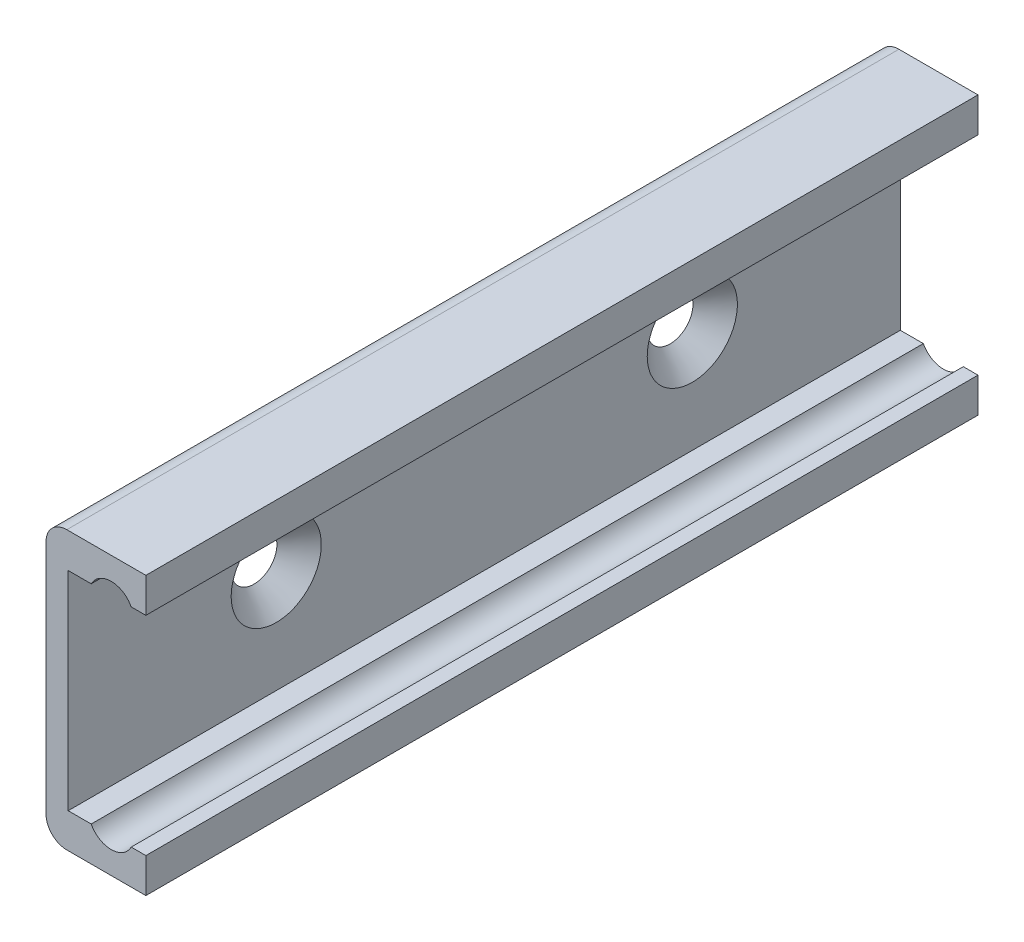
ISO-10303-21;
HEADER;
FILE_DESCRIPTION(('STEP AP214'),'2;1');
FILE_NAME('part.step','',(''),(''),'','','');
FILE_SCHEMA(('AUTOMOTIVE_DESIGN { 1 0 10303 214 1 1 1 1 }'));
ENDSEC;
DATA;
#1=APPLICATION_CONTEXT('core data for automotive mechanical design processes');
#2=APPLICATION_PROTOCOL_DEFINITION('international standard','automotive_design',2000,#1);
#3=PRODUCT_CONTEXT('',#1,'mechanical');
#4=PRODUCT('Part','Part','',(#3));
#5=PRODUCT_RELATED_PRODUCT_CATEGORY('part','',(#4));
#6=PRODUCT_DEFINITION_FORMATION('','',#4);
#7=PRODUCT_DEFINITION_CONTEXT('part definition',#1,'design');
#8=PRODUCT_DEFINITION('design','',#6,#7);
#9=PRODUCT_DEFINITION_SHAPE('','',#8);
#10=(LENGTH_UNIT() NAMED_UNIT(*) SI_UNIT(.MILLI.,.METRE.));
#11=(NAMED_UNIT(*) PLANE_ANGLE_UNIT() SI_UNIT($,.RADIAN.));
#12=(NAMED_UNIT(*) SI_UNIT($,.STERADIAN.) SOLID_ANGLE_UNIT());
#13=UNCERTAINTY_MEASURE_WITH_UNIT(LENGTH_MEASURE(1.E-05),#10,'distance_accuracy_value','');
#14=(GEOMETRIC_REPRESENTATION_CONTEXT(3) GLOBAL_UNCERTAINTY_ASSIGNED_CONTEXT((#13)) GLOBAL_UNIT_ASSIGNED_CONTEXT((#10,
#11,#12)) REPRESENTATION_CONTEXT('',''));
#15=CARTESIAN_POINT('',(0.,0.,0.));
#16=DIRECTION('',(0.,0.,1.));
#17=DIRECTION('',(1.,0.,0.));
#18=AXIS2_PLACEMENT_3D('',#15,#16,#17);
#19=CARTESIAN_POINT('',(0.,-8.49999999999983,60.));
#20=DIRECTION('',(-1.,0.,0.));
#21=DIRECTION('',(0.,0.,1.));
#22=AXIS2_PLACEMENT_3D('',#19,#20,#21);
#23=PLANE('',#22);
#24=CARTESIAN_POINT('',(0.,0.,15.));
#25=DIRECTION('',(-1.,0.,0.));
#26=DIRECTION('',(0.,0.,1.));
#27=AXIS2_PLACEMENT_3D('',#24,#25,#26);
#28=CIRCLE('',#27,1.65);
#29=CARTESIAN_POINT('',(0.,0.,16.65));
#30=VERTEX_POINT('',#29);
#31=EDGE_CURVE('E343',#30,#30,#28,.T.);
#32=ORIENTED_EDGE('',*,*,#31,.F.);
#33=EDGE_LOOP('',(#32));
#34=FACE_BOUND('',#33,.T.);
#35=DIRECTION('',(0.,1.,0.));
#36=VECTOR('',#35,1.);
#37=CARTESIAN_POINT('',(0.,-8.49999999999983,0.));
#38=LINE('',#37,#36);
#39=CARTESIAN_POINT('',(0.,-8.49999999999983,0.));
#40=VERTEX_POINT('',#39);
#41=CARTESIAN_POINT('',(0.,8.49999999999983,0.));
#42=VERTEX_POINT('',#41);
#43=EDGE_CURVE('E170',#40,#42,#38,.T.);
#44=ORIENTED_EDGE('',*,*,#43,.F.);
#45=DIRECTION('',(0.,0.,-1.));
#46=VECTOR('',#45,1.);
#47=CARTESIAN_POINT('',(0.,-8.49999999999983,60.));
#48=LINE('',#47,#46);
#49=CARTESIAN_POINT('',(0.,-8.49999999999983,60.));
#50=VERTEX_POINT('',#49);
#51=EDGE_CURVE('E212',#50,#40,#48,.T.);
#52=ORIENTED_EDGE('',*,*,#51,.F.);
#53=DIRECTION('',(0.,1.,0.));
#54=VECTOR('',#53,1.);
#55=CARTESIAN_POINT('',(0.,-8.49999999999983,60.));
#56=LINE('',#55,#54);
#57=CARTESIAN_POINT('',(0.,8.49999999999983,60.));
#58=VERTEX_POINT('',#57);
#59=EDGE_CURVE('E217',#50,#58,#56,.T.);
#60=ORIENTED_EDGE('',*,*,#59,.T.);
#61=DIRECTION('',(0.,0.,-1.));
#62=VECTOR('',#61,1.);
#63=CARTESIAN_POINT('',(0.,8.49999999999983,60.));
#64=LINE('',#63,#62);
#65=EDGE_CURVE('E215',#58,#42,#64,.T.);
#66=ORIENTED_EDGE('',*,*,#65,.T.);
#67=EDGE_LOOP('',(#44,#52,#60,#66));
#68=FACE_BOUND('',#67,.T.);
#69=CARTESIAN_POINT('',(0.,0.,45.));
#70=DIRECTION('',(-1.,0.,0.));
#71=DIRECTION('',(0.,0.,1.));
#72=AXIS2_PLACEMENT_3D('',#69,#70,#71);
#73=CIRCLE('',#72,1.65);
#74=CARTESIAN_POINT('',(0.,0.,46.65));
#75=VERTEX_POINT('',#74);
#76=EDGE_CURVE('E404',#75,#75,#73,.T.);
#77=ORIENTED_EDGE('',*,*,#76,.F.);
#78=EDGE_LOOP('',(#77));
#79=FACE_BOUND('',#78,.T.);
#80=ADVANCED_FACE('F20',(#34,#68,#79),#23,.T.);
#81=CARTESIAN_POINT('',(7.19999999999986,7.50000000000011,60.));
#82=DIRECTION('',(0.,-1.,0.));
#83=DIRECTION('',(0.,0.,-1.));
#84=AXIS2_PLACEMENT_3D('',#81,#82,#83);
#85=PLANE('',#84);
#86=DIRECTION('',(0.,0.,1.));
#87=VECTOR('',#86,1.);
#88=CARTESIAN_POINT('',(6.14157032433379,7.50000000000011,-1.));
#89=LINE('',#88,#87);
#90=CARTESIAN_POINT('',(6.14157032433379,7.50000000000011,0.));
#91=VERTEX_POINT('',#90);
#92=CARTESIAN_POINT('',(6.14157032433379,7.50000000000011,60.));
#93=VERTEX_POINT('',#92);
#94=EDGE_CURVE('E120',#91,#93,#89,.T.);
#95=ORIENTED_EDGE('',*,*,#94,.F.);
#96=DIRECTION('',(-1.,0.,0.));
#97=VECTOR('',#96,1.);
#98=CARTESIAN_POINT('',(7.19999999999986,7.50000000000011,0.));
#99=LINE('',#98,#97);
#100=CARTESIAN_POINT('',(7.19999999999986,7.50000000000011,0.));
#101=VERTEX_POINT('',#100);
#102=EDGE_CURVE('E129',#101,#91,#99,.T.);
#103=ORIENTED_EDGE('',*,*,#102,.F.);
#104=DIRECTION('',(0.,0.,-1.));
#105=VECTOR('',#104,1.);
#106=CARTESIAN_POINT('',(7.19999999999986,7.50000000000011,60.));
#107=LINE('',#106,#105);
#108=CARTESIAN_POINT('',(7.19999999999986,7.50000000000011,60.));
#109=VERTEX_POINT('',#108);
#110=EDGE_CURVE('E254',#109,#101,#107,.T.);
#111=ORIENTED_EDGE('',*,*,#110,.F.);
#112=DIRECTION('',(-1.,0.,0.));
#113=VECTOR('',#112,1.);
#114=CARTESIAN_POINT('',(7.19999999999986,7.50000000000011,60.));
#115=LINE('',#114,#113);
#116=EDGE_CURVE('E132',#109,#93,#115,.T.);
#117=ORIENTED_EDGE('',*,*,#116,.T.);
#118=EDGE_LOOP('',(#95,#103,#111,#117));
#119=FACE_BOUND('',#118,.T.);
#120=ADVANCED_FACE('F128',(#119),#85,.T.);
#121=CARTESIAN_POINT('',(1.59999999999986,-7.49999999999983,60.));
#122=DIRECTION('',(0.,1.,0.));
#123=DIRECTION('',(0.,0.,1.));
#124=AXIS2_PLACEMENT_3D('',#121,#122,#123);
#125=PLANE('',#124);
#126=DIRECTION('',(0.,0.,1.));
#127=VECTOR('',#126,1.);
#128=CARTESIAN_POINT('',(3.25842967566606,-7.49999999999983,-1.));
#129=LINE('',#128,#127);
#130=CARTESIAN_POINT('',(3.25842967566606,-7.49999999999983,0.));
#131=VERTEX_POINT('',#130);
#132=CARTESIAN_POINT('',(3.25842967566606,-7.49999999999983,60.));
#133=VERTEX_POINT('',#132);
#134=EDGE_CURVE('E304',#131,#133,#129,.T.);
#135=ORIENTED_EDGE('',*,*,#134,.F.);
#136=DIRECTION('',(1.,0.,0.));
#137=VECTOR('',#136,1.);
#138=CARTESIAN_POINT('',(1.59999999999986,-7.49999999999983,0.));
#139=LINE('',#138,#137);
#140=CARTESIAN_POINT('',(1.59999999999986,-7.49999999999983,0.));
#141=VERTEX_POINT('',#140);
#142=EDGE_CURVE('E384',#141,#131,#139,.T.);
#143=ORIENTED_EDGE('',*,*,#142,.F.);
#144=DIRECTION('',(0.,0.,-1.));
#145=VECTOR('',#144,1.);
#146=CARTESIAN_POINT('',(1.59999999999986,-7.49999999999983,60.));
#147=LINE('',#146,#145);
#148=CARTESIAN_POINT('',(1.59999999999986,-7.49999999999983,60.));
#149=VERTEX_POINT('',#148);
#150=EDGE_CURVE('E247',#149,#141,#147,.T.);
#151=ORIENTED_EDGE('',*,*,#150,.F.);
#152=DIRECTION('',(1.,0.,0.));
#153=VECTOR('',#152,1.);
#154=CARTESIAN_POINT('',(1.59999999999986,-7.49999999999983,60.));
#155=LINE('',#154,#153);
#156=EDGE_CURVE('E276',#149,#133,#155,.T.);
#157=ORIENTED_EDGE('',*,*,#156,.T.);
#158=EDGE_LOOP('',(#135,#143,#151,#157));
#159=FACE_BOUND('',#158,.T.);
#160=ADVANCED_FACE('F511',(#159),#125,.T.);
#161=CARTESIAN_POINT('',(1.5,10.,60.));
#162=DIRECTION('',(0.,1.,0.));
#163=DIRECTION('',(0.,0.,1.));
#164=AXIS2_PLACEMENT_3D('',#161,#162,#163);
#165=PLANE('',#164);
#166=DIRECTION('',(1.,0.,0.));
#167=VECTOR('',#166,1.);
#168=CARTESIAN_POINT('',(1.5,10.,0.));
#169=LINE('',#168,#167);
#170=CARTESIAN_POINT('',(1.5,9.99999999999983,0.));
#171=VERTEX_POINT('',#170);
#172=CARTESIAN_POINT('',(7.19999999999986,10.,0.));
#173=VERTEX_POINT('',#172);
#174=EDGE_CURVE('E172',#171,#173,#169,.T.);
#175=ORIENTED_EDGE('',*,*,#174,.F.);
#176=DIRECTION('',(0.,0.,-1.));
#177=VECTOR('',#176,1.);
#178=CARTESIAN_POINT('',(1.5,9.99999999999983,60.));
#179=LINE('',#178,#177);
#180=CARTESIAN_POINT('',(1.5,9.99999999999983,60.));
#181=VERTEX_POINT('',#180);
#182=EDGE_CURVE('E221',#181,#171,#179,.T.);
#183=ORIENTED_EDGE('',*,*,#182,.F.);
#184=DIRECTION('',(1.,0.,0.));
#185=VECTOR('',#184,1.);
#186=CARTESIAN_POINT('',(1.5,10.,60.));
#187=LINE('',#186,#185);
#188=CARTESIAN_POINT('',(7.19999999999986,10.,60.));
#189=VERTEX_POINT('',#188);
#190=EDGE_CURVE('E169',#181,#189,#187,.T.);
#191=ORIENTED_EDGE('',*,*,#190,.T.);
#192=DIRECTION('',(0.,0.,-1.));
#193=VECTOR('',#192,1.);
#194=CARTESIAN_POINT('',(7.19999999999986,10.,60.));
#195=LINE('',#194,#193);
#196=EDGE_CURVE('E257',#189,#173,#195,.T.);
#197=ORIENTED_EDGE('',*,*,#196,.T.);
#198=EDGE_LOOP('',(#175,#183,#191,#197));
#199=FACE_BOUND('',#198,.T.);
#200=ADVANCED_FACE('F22',(#199),#165,.T.);
#201=CARTESIAN_POINT('',(1.5,8.49999999999983,60.));
#202=DIRECTION('',(0.,0.,-1.));
#203=DIRECTION('',(-1.,0.,0.));
#204=AXIS2_PLACEMENT_3D('',#201,#202,#203);
#205=CYLINDRICAL_SURFACE('',#204,1.5);
#206=CARTESIAN_POINT('',(1.5,8.49999999999983,0.));
#207=DIRECTION('',(0.,0.,1.));
#208=DIRECTION('',(1.,0.,0.));
#209=AXIS2_PLACEMENT_3D('',#206,#207,#208);
#210=CIRCLE('',#209,1.5);
#211=EDGE_CURVE('E163',#171,#42,#210,.T.);
#212=ORIENTED_EDGE('',*,*,#211,.T.);
#213=ORIENTED_EDGE('',*,*,#65,.F.);
#214=CARTESIAN_POINT('',(1.5,8.49999999999983,60.));
#215=DIRECTION('',(0.,0.,1.));
#216=DIRECTION('',(1.,0.,0.));
#217=AXIS2_PLACEMENT_3D('',#214,#215,#216);
#218=CIRCLE('',#217,1.5);
#219=EDGE_CURVE('E224',#181,#58,#218,.T.);
#220=ORIENTED_EDGE('',*,*,#219,.F.);
#221=ORIENTED_EDGE('',*,*,#182,.T.);
#222=EDGE_LOOP('',(#212,#213,#220,#221));
#223=FACE_BOUND('',#222,.T.);
#224=ADVANCED_FACE('F223',(#223),#205,.T.);
#225=CARTESIAN_POINT('',(1.5,-8.49999999999983,60.));
#226=DIRECTION('',(0.,0.,-1.));
#227=DIRECTION('',(-1.,0.,0.));
#228=AXIS2_PLACEMENT_3D('',#225,#226,#227);
#229=CYLINDRICAL_SURFACE('',#228,1.5);
#230=CARTESIAN_POINT('',(1.5,-8.49999999999983,0.));
#231=DIRECTION('',(0.,0.,1.));
#232=DIRECTION('',(1.,0.,0.));
#233=AXIS2_PLACEMENT_3D('',#230,#231,#232);
#234=CIRCLE('',#233,1.5);
#235=CARTESIAN_POINT('',(1.5,-10.0000000000002,0.));
#236=VERTEX_POINT('',#235);
#237=EDGE_CURVE('E192',#40,#236,#234,.T.);
#238=ORIENTED_EDGE('',*,*,#237,.T.);
#239=DIRECTION('',(0.,0.,-1.));
#240=VECTOR('',#239,1.);
#241=CARTESIAN_POINT('',(1.5,-10.0000000000002,60.));
#242=LINE('',#241,#240);
#243=CARTESIAN_POINT('',(1.5,-10.0000000000002,60.));
#244=VERTEX_POINT('',#243);
#245=EDGE_CURVE('E237',#244,#236,#242,.T.);
#246=ORIENTED_EDGE('',*,*,#245,.F.);
#247=CARTESIAN_POINT('',(1.5,-8.49999999999983,60.));
#248=DIRECTION('',(0.,0.,1.));
#249=DIRECTION('',(1.,0.,0.));
#250=AXIS2_PLACEMENT_3D('',#247,#248,#249);
#251=CIRCLE('',#250,1.5);
#252=EDGE_CURVE('E264',#50,#244,#251,.T.);
#253=ORIENTED_EDGE('',*,*,#252,.F.);
#254=ORIENTED_EDGE('',*,*,#51,.T.);
#255=EDGE_LOOP('',(#238,#246,#253,#254));
#256=FACE_BOUND('',#255,.T.);
#257=ADVANCED_FACE('F529',(#256),#229,.T.);
#258=CARTESIAN_POINT('',(1.5,-10.0000000000002,60.));
#259=DIRECTION('',(0.,1.,0.));
#260=DIRECTION('',(0.,0.,1.));
#261=AXIS2_PLACEMENT_3D('',#258,#259,#260);
#262=PLANE('',#261);
#263=DIRECTION('',(1.,0.,0.));
#264=VECTOR('',#263,1.);
#265=CARTESIAN_POINT('',(1.5,-10.0000000000002,0.));
#266=LINE('',#265,#264);
#267=CARTESIAN_POINT('',(7.19999999999986,-10.0000000000002,0.));
#268=VERTEX_POINT('',#267);
#269=EDGE_CURVE('E188',#236,#268,#266,.T.);
#270=ORIENTED_EDGE('',*,*,#269,.T.);
#271=DIRECTION('',(0.,0.,-1.));
#272=VECTOR('',#271,1.);
#273=CARTESIAN_POINT('',(7.19999999999986,-10.0000000000002,60.));
#274=LINE('',#273,#272);
#275=CARTESIAN_POINT('',(7.19999999999986,-10.0000000000002,60.));
#276=VERTEX_POINT('',#275);
#277=EDGE_CURVE('E240',#276,#268,#274,.T.);
#278=ORIENTED_EDGE('',*,*,#277,.F.);
#279=DIRECTION('',(1.,0.,0.));
#280=VECTOR('',#279,1.);
#281=CARTESIAN_POINT('',(1.5,-10.0000000000002,60.));
#282=LINE('',#281,#280);
#283=EDGE_CURVE('E269',#244,#276,#282,.T.);
#284=ORIENTED_EDGE('',*,*,#283,.F.);
#285=ORIENTED_EDGE('',*,*,#245,.T.);
#286=EDGE_LOOP('',(#270,#278,#284,#285));
#287=FACE_BOUND('',#286,.T.);
#288=ADVANCED_FACE('F519',(#287),#262,.F.);
#289=CARTESIAN_POINT('',(7.19999999999986,-7.49999999999983,60.));
#290=DIRECTION('',(1.,0.,0.));
#291=DIRECTION('',(0.,0.,-1.));
#292=AXIS2_PLACEMENT_3D('',#289,#290,#291);
#293=PLANE('',#292);
#294=DIRECTION('',(0.,-1.,0.));
#295=VECTOR('',#294,1.);
#296=CARTESIAN_POINT('',(7.19999999999986,-7.49999999999983,0.));
#297=LINE('',#296,#295);
#298=CARTESIAN_POINT('',(7.19999999999986,-7.49999999999983,0.));
#299=VERTEX_POINT('',#298);
#300=EDGE_CURVE('E193',#299,#268,#297,.T.);
#301=ORIENTED_EDGE('',*,*,#300,.F.);
#302=DIRECTION('',(0.,0.,-1.));
#303=VECTOR('',#302,1.);
#304=CARTESIAN_POINT('',(7.19999999999986,-7.49999999999983,60.));
#305=LINE('',#304,#303);
#306=CARTESIAN_POINT('',(7.19999999999986,-7.49999999999983,60.));
#307=VERTEX_POINT('',#306);
#308=EDGE_CURVE('E243',#307,#299,#305,.T.);
#309=ORIENTED_EDGE('',*,*,#308,.F.);
#310=DIRECTION('',(0.,-1.,0.));
#311=VECTOR('',#310,1.);
#312=CARTESIAN_POINT('',(7.19999999999986,-7.49999999999983,60.));
#313=LINE('',#312,#311);
#314=EDGE_CURVE('E272',#307,#276,#313,.T.);
#315=ORIENTED_EDGE('',*,*,#314,.T.);
#316=ORIENTED_EDGE('',*,*,#277,.T.);
#317=EDGE_LOOP('',(#301,#309,#315,#316));
#318=FACE_BOUND('',#317,.T.);
#319=ADVANCED_FACE('F509',(#318),#293,.T.);
#320=DIRECTION('',(0.,0.,1.));
#321=VECTOR('',#320,1.);
#322=CARTESIAN_POINT('',(6.14157032433394,-7.49999999999983,-1.));
#323=LINE('',#322,#321);
#324=CARTESIAN_POINT('',(6.14157032433394,-7.49999999999983,60.));
#325=VERTEX_POINT('',#324);
#326=CARTESIAN_POINT('',(6.14157032433394,-7.49999999999983,0.));
#327=VERTEX_POINT('',#326);
#328=EDGE_CURVE('E43',#325,#327,#323,.F.);
#329=ORIENTED_EDGE('',*,*,#328,.F.);
#330=EDGE_CURVE('E280',#325,#307,#155,.T.);
#331=ORIENTED_EDGE('',*,*,#330,.T.);
#332=ORIENTED_EDGE('',*,*,#308,.T.);
#333=EDGE_CURVE('E149',#327,#299,#139,.T.);
#334=ORIENTED_EDGE('',*,*,#333,.F.);
#335=EDGE_LOOP('',(#329,#331,#332,#334));
#336=FACE_BOUND('',#335,.T.);
#337=ADVANCED_FACE('F321',(#336),#125,.T.);
#338=CARTESIAN_POINT('',(1.59999999999986,7.50000000000011,60.));
#339=DIRECTION('',(1.,0.,0.));
#340=DIRECTION('',(0.,0.,-1.));
#341=AXIS2_PLACEMENT_3D('',#338,#339,#340);
#342=PLANE('',#341);
#343=CARTESIAN_POINT('',(1.59999999999982,0.,45.));
#344=DIRECTION('',(-1.,0.,0.));
#345=DIRECTION('',(0.,0.,1.));
#346=AXIS2_PLACEMENT_3D('',#343,#344,#345);
#347=CIRCLE('',#346,3.25);
#348=CARTESIAN_POINT('',(1.59999999999982,0.,48.25));
#349=VERTEX_POINT('',#348);
#350=EDGE_CURVE('E410',#349,#349,#347,.T.);
#351=ORIENTED_EDGE('',*,*,#350,.T.);
#352=EDGE_LOOP('',(#351));
#353=FACE_BOUND('',#352,.T.);
#354=CARTESIAN_POINT('',(1.59999999999982,0.,15.));
#355=DIRECTION('',(-1.,0.,0.));
#356=DIRECTION('',(0.,0.,1.));
#357=AXIS2_PLACEMENT_3D('',#354,#355,#356);
#358=CIRCLE('',#357,3.25);
#359=CARTESIAN_POINT('',(1.59999999999982,0.,18.25));
#360=VERTEX_POINT('',#359);
#361=EDGE_CURVE('E409',#360,#360,#358,.T.);
#362=ORIENTED_EDGE('',*,*,#361,.T.);
#363=EDGE_LOOP('',(#362));
#364=FACE_BOUND('',#363,.T.);
#365=DIRECTION('',(0.,-1.,0.));
#366=VECTOR('',#365,1.);
#367=CARTESIAN_POINT('',(1.59999999999986,7.50000000000011,0.));
#368=LINE('',#367,#366);
#369=CARTESIAN_POINT('',(1.59999999999986,7.50000000000011,0.));
#370=VERTEX_POINT('',#369);
#371=EDGE_CURVE('E141',#370,#141,#368,.T.);
#372=ORIENTED_EDGE('',*,*,#371,.F.);
#373=DIRECTION('',(0.,0.,-1.));
#374=VECTOR('',#373,1.);
#375=CARTESIAN_POINT('',(1.59999999999986,7.50000000000011,60.));
#376=LINE('',#375,#374);
#377=CARTESIAN_POINT('',(1.59999999999986,7.50000000000011,60.));
#378=VERTEX_POINT('',#377);
#379=EDGE_CURVE('E250',#378,#370,#376,.T.);
#380=ORIENTED_EDGE('',*,*,#379,.F.);
#381=DIRECTION('',(0.,-1.,0.));
#382=VECTOR('',#381,1.);
#383=CARTESIAN_POINT('',(1.59999999999986,7.50000000000011,60.));
#384=LINE('',#383,#382);
#385=EDGE_CURVE('E281',#378,#149,#384,.T.);
#386=ORIENTED_EDGE('',*,*,#385,.T.);
#387=ORIENTED_EDGE('',*,*,#150,.T.);
#388=EDGE_LOOP('',(#372,#380,#386,#387));
#389=FACE_BOUND('',#388,.T.);
#390=ADVANCED_FACE('F491',(#353,#364,#389),#342,.T.);
#391=DIRECTION('',(0.,0.,1.));
#392=VECTOR('',#391,1.);
#393=CARTESIAN_POINT('',(3.25842967566621,7.50000000000011,-1.));
#394=LINE('',#393,#392);
#395=CARTESIAN_POINT('',(3.25842967566621,7.50000000000011,60.));
#396=VERTEX_POINT('',#395);
#397=CARTESIAN_POINT('',(3.25842967566621,7.50000000000011,0.));
#398=VERTEX_POINT('',#397);
#399=EDGE_CURVE('E36',#396,#398,#394,.F.);
#400=ORIENTED_EDGE('',*,*,#399,.F.);
#401=EDGE_CURVE('E285',#396,#378,#115,.T.);
#402=ORIENTED_EDGE('',*,*,#401,.T.);
#403=ORIENTED_EDGE('',*,*,#379,.T.);
#404=EDGE_CURVE('E142',#398,#370,#99,.T.);
#405=ORIENTED_EDGE('',*,*,#404,.F.);
#406=EDGE_LOOP('',(#400,#402,#403,#405));
#407=FACE_BOUND('',#406,.T.);
#408=ADVANCED_FACE('F483',(#407),#85,.T.);
#409=CARTESIAN_POINT('',(7.19999999999986,10.,60.));
#410=DIRECTION('',(1.,0.,0.));
#411=DIRECTION('',(0.,0.,-1.));
#412=AXIS2_PLACEMENT_3D('',#409,#410,#411);
#413=PLANE('',#412);
#414=DIRECTION('',(0.,-1.,0.));
#415=VECTOR('',#414,1.);
#416=CARTESIAN_POINT('',(7.19999999999986,10.,0.));
#417=LINE('',#416,#415);
#418=EDGE_CURVE('E139',#173,#101,#417,.T.);
#419=ORIENTED_EDGE('',*,*,#418,.F.);
#420=ORIENTED_EDGE('',*,*,#196,.F.);
#421=DIRECTION('',(0.,-1.,0.));
#422=VECTOR('',#421,1.);
#423=CARTESIAN_POINT('',(7.19999999999986,10.,60.));
#424=LINE('',#423,#422);
#425=EDGE_CURVE('E177',#189,#109,#424,.T.);
#426=ORIENTED_EDGE('',*,*,#425,.T.);
#427=ORIENTED_EDGE('',*,*,#110,.T.);
#428=EDGE_LOOP('',(#419,#420,#426,#427));
#429=FACE_BOUND('',#428,.T.);
#430=ADVANCED_FACE('F474',(#429),#413,.T.);
#431=CARTESIAN_POINT('',(1.5,-8.49999999999983,60.));
#432=DIRECTION('',(0.,0.,1.));
#433=DIRECTION('',(1.,0.,0.));
#434=AXIS2_PLACEMENT_3D('',#431,#432,#433);
#435=PLANE('',#434);
#436=CARTESIAN_POINT('',(4.7,6.75,60.));
#437=DIRECTION('',(0.,0.,1.));
#438=DIRECTION('',(1.,0.,0.));
#439=AXIS2_PLACEMENT_3D('',#436,#437,#438);
#440=CIRCLE('',#439,1.625);
#441=EDGE_CURVE('E134',#93,#396,#440,.T.);
#442=ORIENTED_EDGE('',*,*,#441,.F.);
#443=ORIENTED_EDGE('',*,*,#116,.F.);
#444=ORIENTED_EDGE('',*,*,#425,.F.);
#445=ORIENTED_EDGE('',*,*,#190,.F.);
#446=ORIENTED_EDGE('',*,*,#219,.T.);
#447=ORIENTED_EDGE('',*,*,#59,.F.);
#448=ORIENTED_EDGE('',*,*,#252,.T.);
#449=ORIENTED_EDGE('',*,*,#283,.T.);
#450=ORIENTED_EDGE('',*,*,#314,.F.);
#451=ORIENTED_EDGE('',*,*,#330,.F.);
#452=CARTESIAN_POINT('',(4.7,-6.75,60.));
#453=DIRECTION('',(0.,0.,1.));
#454=DIRECTION('',(1.,0.,0.));
#455=AXIS2_PLACEMENT_3D('',#452,#453,#454);
#456=CIRCLE('',#455,1.625);
#457=EDGE_CURVE('E176',#133,#325,#456,.T.);
#458=ORIENTED_EDGE('',*,*,#457,.F.);
#459=ORIENTED_EDGE('',*,*,#156,.F.);
#460=ORIENTED_EDGE('',*,*,#385,.F.);
#461=ORIENTED_EDGE('',*,*,#401,.F.);
#462=EDGE_LOOP('',(#442,#443,#444,#445,#446,#447,#448,#449,#450,#451,#458,#459,#460,#461));
#463=FACE_BOUND('',#462,.T.);
#464=ADVANCED_FACE('F299',(#463),#435,.T.);
#465=CARTESIAN_POINT('',(1.5,-8.49999999999983,0.));
#466=DIRECTION('',(0.,0.,1.));
#467=DIRECTION('',(1.,0.,0.));
#468=AXIS2_PLACEMENT_3D('',#465,#466,#467);
#469=PLANE('',#468);
#470=ORIENTED_EDGE('',*,*,#102,.T.);
#471=CARTESIAN_POINT('',(4.7,6.75,0.));
#472=DIRECTION('',(0.,0.,1.));
#473=DIRECTION('',(1.,0.,0.));
#474=AXIS2_PLACEMENT_3D('',#471,#472,#473);
#475=CIRCLE('',#474,1.625);
#476=EDGE_CURVE('E12',#91,#398,#475,.T.);
#477=ORIENTED_EDGE('',*,*,#476,.T.);
#478=ORIENTED_EDGE('',*,*,#404,.T.);
#479=ORIENTED_EDGE('',*,*,#371,.T.);
#480=ORIENTED_EDGE('',*,*,#142,.T.);
#481=CARTESIAN_POINT('',(4.7,-6.75,0.));
#482=DIRECTION('',(0.,0.,1.));
#483=DIRECTION('',(1.,0.,0.));
#484=AXIS2_PLACEMENT_3D('',#481,#482,#483);
#485=CIRCLE('',#484,1.625);
#486=EDGE_CURVE('E29',#131,#327,#485,.T.);
#487=ORIENTED_EDGE('',*,*,#486,.T.);
#488=ORIENTED_EDGE('',*,*,#333,.T.);
#489=ORIENTED_EDGE('',*,*,#300,.T.);
#490=ORIENTED_EDGE('',*,*,#269,.F.);
#491=ORIENTED_EDGE('',*,*,#237,.F.);
#492=ORIENTED_EDGE('',*,*,#43,.T.);
#493=ORIENTED_EDGE('',*,*,#211,.F.);
#494=ORIENTED_EDGE('',*,*,#174,.T.);
#495=ORIENTED_EDGE('',*,*,#418,.T.);
#496=EDGE_LOOP('',(#470,#477,#478,#479,#480,#487,#488,#489,#490,#491,#492,#493,#494,#495));
#497=FACE_BOUND('',#496,.T.);
#498=ADVANCED_FACE('F136',(#497),#469,.F.);
#499=CARTESIAN_POINT('',(4.7,-6.75,-1.));
#500=DIRECTION('',(0.,0.,1.));
#501=DIRECTION('',(0.,1.,0.));
#502=AXIS2_PLACEMENT_3D('',#499,#500,#501);
#503=CYLINDRICAL_SURFACE('',#502,1.625);
#504=ORIENTED_EDGE('',*,*,#457,.T.);
#505=ORIENTED_EDGE('',*,*,#328,.T.);
#506=ORIENTED_EDGE('',*,*,#486,.F.);
#507=ORIENTED_EDGE('',*,*,#134,.T.);
#508=EDGE_LOOP('',(#504,#505,#506,#507));
#509=FACE_BOUND('',#508,.T.);
#510=ADVANCED_FACE('F315',(#509),#503,.F.);
#511=CARTESIAN_POINT('',(4.7,6.75,-1.));
#512=DIRECTION('',(0.,0.,1.));
#513=DIRECTION('',(0.,1.,0.));
#514=AXIS2_PLACEMENT_3D('',#511,#512,#513);
#515=CYLINDRICAL_SURFACE('',#514,1.625);
#516=ORIENTED_EDGE('',*,*,#441,.T.);
#517=ORIENTED_EDGE('',*,*,#399,.T.);
#518=ORIENTED_EDGE('',*,*,#476,.F.);
#519=ORIENTED_EDGE('',*,*,#94,.T.);
#520=EDGE_LOOP('',(#516,#517,#518,#519));
#521=FACE_BOUND('',#520,.T.);
#522=ADVANCED_FACE('F119',(#521),#515,.F.);
#523=CARTESIAN_POINT('',(1.59999999999982,0.,15.));
#524=DIRECTION('',(1.,0.,0.));
#525=DIRECTION('',(0.,0.,-1.));
#526=AXIS2_PLACEMENT_3D('',#523,#524,#525);
#527=CONICAL_SURFACE('',#526,3.25,0.785398163397506);
#528=ORIENTED_EDGE('',*,*,#31,.T.);
#529=EDGE_LOOP('',(#528));
#530=FACE_BOUND('',#529,.T.);
#531=ORIENTED_EDGE('',*,*,#361,.F.);
#532=EDGE_LOOP('',(#531));
#533=FACE_BOUND('',#532,.T.);
#534=ADVANCED_FACE('F430',(#530,#533),#527,.F.);
#535=CARTESIAN_POINT('',(1.59999999999982,0.,45.));
#536=DIRECTION('',(1.,0.,0.));
#537=DIRECTION('',(0.,0.,-1.));
#538=AXIS2_PLACEMENT_3D('',#535,#536,#537);
#539=CONICAL_SURFACE('',#538,3.25,0.785398163397506);
#540=ORIENTED_EDGE('',*,*,#76,.T.);
#541=EDGE_LOOP('',(#540));
#542=FACE_BOUND('',#541,.T.);
#543=ORIENTED_EDGE('',*,*,#350,.F.);
#544=EDGE_LOOP('',(#543));
#545=FACE_BOUND('',#544,.T.);
#546=ADVANCED_FACE('F425',(#542,#545),#539,.F.);
#547=CLOSED_SHELL('',(#80,#120,#160,#200,#224,#257,#288,#319,#337,#390,#408,#430,#464,#498,#510,
#522,#534,#546));
#548=MANIFOLD_SOLID_BREP('B1',#547);
#549=ADVANCED_BREP_SHAPE_REPRESENTATION('',(#18,#548),#14);
#550=SHAPE_DEFINITION_REPRESENTATION(#9,#549);
ENDSEC;
END-ISO-10303-21;
